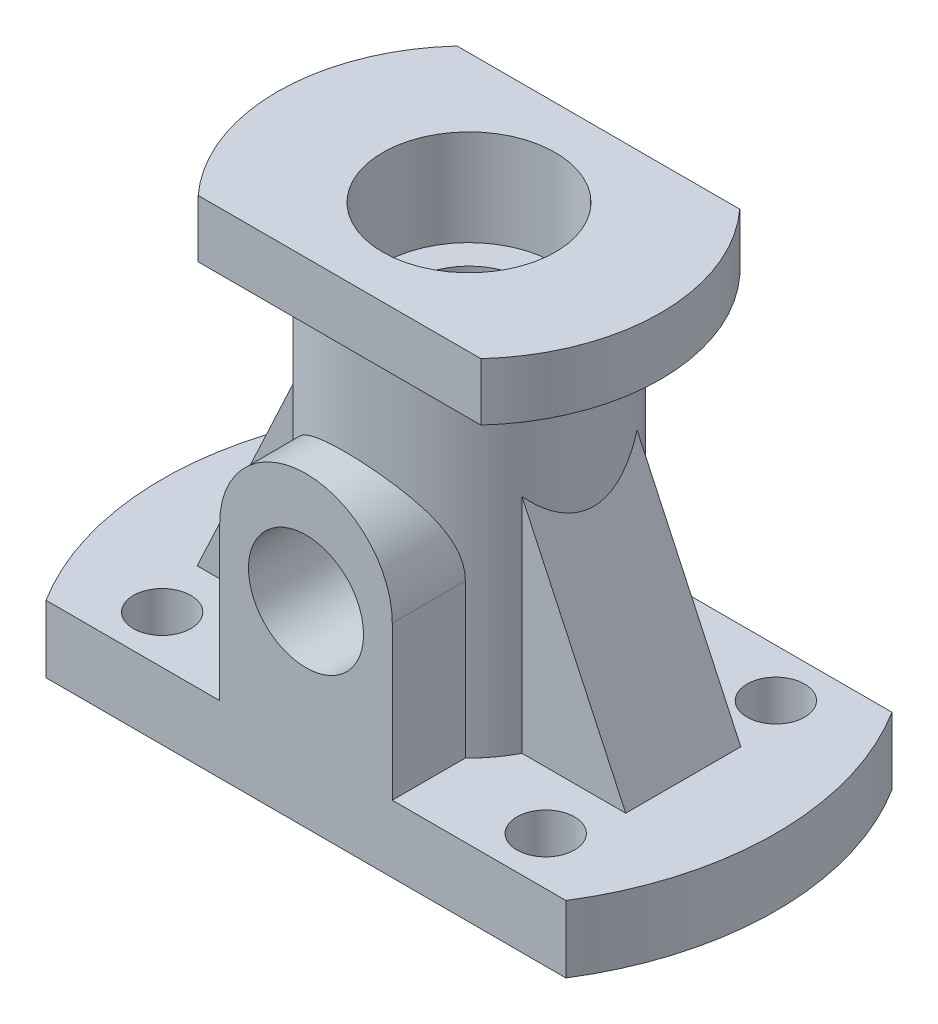
ISO-10303-21;
HEADER;
FILE_DESCRIPTION(('STEP AP214'),'2;1');
FILE_NAME('part.step','',(''),(''),'','','');
FILE_SCHEMA(('AUTOMOTIVE_DESIGN { 1 0 10303 214 1 1 1 1 }'));
ENDSEC;
DATA;
#1=APPLICATION_CONTEXT('core data for automotive mechanical design processes');
#2=APPLICATION_PROTOCOL_DEFINITION('international standard','automotive_design',2000,#1);
#3=PRODUCT_CONTEXT('',#1,'mechanical');
#4=PRODUCT('Part','Part','',(#3));
#5=PRODUCT_RELATED_PRODUCT_CATEGORY('part','',(#4));
#6=PRODUCT_DEFINITION_FORMATION('','',#4);
#7=PRODUCT_DEFINITION_CONTEXT('part definition',#1,'design');
#8=PRODUCT_DEFINITION('design','',#6,#7);
#9=PRODUCT_DEFINITION_SHAPE('','',#8);
#10=(LENGTH_UNIT() NAMED_UNIT(*) SI_UNIT(.MILLI.,.METRE.));
#11=(NAMED_UNIT(*) PLANE_ANGLE_UNIT() SI_UNIT($,.RADIAN.));
#12=(NAMED_UNIT(*) SI_UNIT($,.STERADIAN.) SOLID_ANGLE_UNIT());
#13=UNCERTAINTY_MEASURE_WITH_UNIT(LENGTH_MEASURE(1.E-05),#10,'distance_accuracy_value','');
#14=(GEOMETRIC_REPRESENTATION_CONTEXT(3) GLOBAL_UNCERTAINTY_ASSIGNED_CONTEXT((#13)) GLOBAL_UNIT_ASSIGNED_CONTEXT((#10,
#11,#12)) REPRESENTATION_CONTEXT('',''));
#15=CARTESIAN_POINT('',(0.,0.,0.));
#16=DIRECTION('',(0.,0.,1.));
#17=DIRECTION('',(1.,0.,0.));
#18=AXIS2_PLACEMENT_3D('',#15,#16,#17);
#19=CARTESIAN_POINT('',(0.,7.,0.));
#20=DIRECTION('',(0.,1.,0.));
#21=DIRECTION('',(0.,0.,1.));
#22=AXIS2_PLACEMENT_3D('',#19,#20,#21);
#23=PLANE('',#22);
#24=DIRECTION('',(-1.,0.,0.));
#25=VECTOR('',#24,1.);
#26=CARTESIAN_POINT('',(0.,7.,-6.));
#27=LINE('',#26,#25);
#28=CARTESIAN_POINT('',(22.3438266157036,7.,-6.));
#29=VERTEX_POINT('',#28);
#30=CARTESIAN_POINT('',(11.5325625946708,7.,-6.));
#31=VERTEX_POINT('',#30);
#32=EDGE_CURVE('E49',#29,#31,#27,.T.);
#33=ORIENTED_EDGE('',*,*,#32,.F.);
#34=DIRECTION('',(0.,0.,1.));
#35=VECTOR('',#34,1.);
#36=CARTESIAN_POINT('',(22.3438266156109,6.99999999997369,-6.));
#37=LINE('',#36,#35);
#38=CARTESIAN_POINT('',(22.343826615618,6.9999999999954,6.));
#39=VERTEX_POINT('',#38);
#40=EDGE_CURVE('E54',#29,#39,#37,.T.);
#41=ORIENTED_EDGE('',*,*,#40,.T.);
#42=DIRECTION('',(-1.,0.,0.));
#43=VECTOR('',#42,1.);
#44=CARTESIAN_POINT('',(0.,7.,6.));
#45=LINE('',#44,#43);
#46=CARTESIAN_POINT('',(11.5325625946708,7.,6.));
#47=VERTEX_POINT('',#46);
#48=EDGE_CURVE('E178',#39,#47,#45,.T.);
#49=ORIENTED_EDGE('',*,*,#48,.T.);
#50=CARTESIAN_POINT('',(0.,7.,0.));
#51=DIRECTION('',(0.,1.,0.));
#52=DIRECTION('',(0.,0.,1.));
#53=AXIS2_PLACEMENT_3D('',#50,#51,#52);
#54=CIRCLE('',#53,13.);
#55=CARTESIAN_POINT('',(8.99999999999999,7.,9.38083151964687));
#56=VERTEX_POINT('',#55);
#57=EDGE_CURVE('E165',#56,#47,#54,.T.);
#58=ORIENTED_EDGE('',*,*,#57,.F.);
#59=DIRECTION('',(0.,0.,1.));
#60=VECTOR('',#59,1.);
#61=CARTESIAN_POINT('',(8.99999999999999,7.,-17.001));
#62=LINE('',#61,#60);
#63=CARTESIAN_POINT('',(8.99999999999999,7.,17.));
#64=VERTEX_POINT('',#63);
#65=EDGE_CURVE('E302',#56,#64,#62,.T.);
#66=ORIENTED_EDGE('',*,*,#65,.T.);
#67=DIRECTION('',(1.,0.,0.));
#68=VECTOR('',#67,1.);
#69=CARTESIAN_POINT('',(-27.1108834234519,7.,17.));
#70=LINE('',#69,#68);
#71=CARTESIAN_POINT('',(27.1108834234519,7.,17.));
#72=VERTEX_POINT('',#71);
#73=EDGE_CURVE('E227',#64,#72,#70,.T.);
#74=ORIENTED_EDGE('',*,*,#73,.T.);
#75=CARTESIAN_POINT('',(0.,7.,0.));
#76=DIRECTION('',(0.,1.,0.));
#77=DIRECTION('',(0.,0.,1.));
#78=AXIS2_PLACEMENT_3D('',#75,#76,#77);
#79=CIRCLE('',#78,32.);
#80=CARTESIAN_POINT('',(27.1108834234519,7.,-17.));
#81=VERTEX_POINT('',#80);
#82=EDGE_CURVE('E222',#72,#81,#79,.T.);
#83=ORIENTED_EDGE('',*,*,#82,.T.);
#84=DIRECTION('',(-1.,0.,0.));
#85=VECTOR('',#84,1.);
#86=CARTESIAN_POINT('',(-27.1108834234519,7.,-17.));
#87=LINE('',#86,#85);
#88=CARTESIAN_POINT('',(-27.1108834234519,7.,-17.));
#89=VERTEX_POINT('',#88);
#90=EDGE_CURVE('E209',#81,#89,#87,.T.);
#91=ORIENTED_EDGE('',*,*,#90,.T.);
#92=CARTESIAN_POINT('',(0.,7.,0.));
#93=DIRECTION('',(0.,1.,0.));
#94=DIRECTION('',(0.,0.,1.));
#95=AXIS2_PLACEMENT_3D('',#92,#93,#94);
#96=CIRCLE('',#95,32.);
#97=CARTESIAN_POINT('',(-27.1108834234519,7.,17.));
#98=VERTEX_POINT('',#97);
#99=EDGE_CURVE('E212',#89,#98,#96,.T.);
#100=ORIENTED_EDGE('',*,*,#99,.T.);
#101=CARTESIAN_POINT('',(-9.,7.,17.));
#102=VERTEX_POINT('',#101);
#103=EDGE_CURVE('E224',#98,#102,#70,.T.);
#104=ORIENTED_EDGE('',*,*,#103,.T.);
#105=DIRECTION('',(0.,0.,1.));
#106=VECTOR('',#105,1.);
#107=CARTESIAN_POINT('',(-9.,7.,-17.001));
#108=LINE('',#107,#106);
#109=CARTESIAN_POINT('',(-9.00000000000001,7.,9.38083151964685));
#110=VERTEX_POINT('',#109);
#111=EDGE_CURVE('E301',#110,#102,#108,.T.);
#112=ORIENTED_EDGE('',*,*,#111,.F.);
#113=CARTESIAN_POINT('',(-11.5325625946708,7.,6.));
#114=VERTEX_POINT('',#113);
#115=EDGE_CURVE('E177',#114,#110,#54,.T.);
#116=ORIENTED_EDGE('',*,*,#115,.F.);
#117=DIRECTION('',(1.,0.,0.));
#118=VECTOR('',#117,1.);
#119=CARTESIAN_POINT('',(0.,7.,6.));
#120=LINE('',#119,#118);
#121=CARTESIAN_POINT('',(-22.3438266156109,6.99999999997813,6.));
#122=VERTEX_POINT('',#121);
#123=EDGE_CURVE('E437',#122,#114,#120,.T.);
#124=ORIENTED_EDGE('',*,*,#123,.F.);
#125=DIRECTION('',(0.,0.,1.));
#126=VECTOR('',#125,1.);
#127=CARTESIAN_POINT('',(-22.3438266156109,6.99999999997813,-6.));
#128=LINE('',#127,#126);
#129=CARTESIAN_POINT('',(-22.3438266156109,6.99999999997813,-6.));
#130=VERTEX_POINT('',#129);
#131=EDGE_CURVE('E448',#130,#122,#128,.T.);
#132=ORIENTED_EDGE('',*,*,#131,.F.);
#133=DIRECTION('',(1.,0.,0.));
#134=VECTOR('',#133,1.);
#135=CARTESIAN_POINT('',(0.,7.,-6.));
#136=LINE('',#135,#134);
#137=CARTESIAN_POINT('',(-11.5325625946708,7.,-6.));
#138=VERTEX_POINT('',#137);
#139=EDGE_CURVE('E444',#130,#138,#136,.T.);
#140=ORIENTED_EDGE('',*,*,#139,.T.);
#141=EDGE_CURVE('E175',#31,#138,#54,.T.);
#142=ORIENTED_EDGE('',*,*,#141,.F.);
#143=EDGE_LOOP('',(#33,#41,#49,#58,#66,#74,#83,#91,#100,#104,#112,#116,#124,#132,#140,#142));
#144=FACE_BOUND('',#143,.T.);
#145=CARTESIAN_POINT('',(-20.,7.,-12.));
#146=DIRECTION('',(0.,-1.,0.));
#147=DIRECTION('',(0.,0.,-1.));
#148=AXIS2_PLACEMENT_3D('',#145,#146,#147);
#149=CIRCLE('',#148,3.);
#150=CARTESIAN_POINT('',(-20.,7.,-15.));
#151=VERTEX_POINT('',#150);
#152=EDGE_CURVE('E248',#151,#151,#149,.T.);
#153=ORIENTED_EDGE('',*,*,#152,.T.);
#154=EDGE_LOOP('',(#153));
#155=FACE_BOUND('',#154,.T.);
#156=CARTESIAN_POINT('',(20.,7.,-12.));
#157=DIRECTION('',(0.,1.,0.));
#158=DIRECTION('',(0.,0.,-1.));
#159=AXIS2_PLACEMENT_3D('',#156,#157,#158);
#160=CIRCLE('',#159,3.);
#161=CARTESIAN_POINT('',(20.,7.,-15.));
#162=VERTEX_POINT('',#161);
#163=EDGE_CURVE('E242',#162,#162,#160,.T.);
#164=ORIENTED_EDGE('',*,*,#163,.F.);
#165=EDGE_LOOP('',(#164));
#166=FACE_BOUND('',#165,.T.);
#167=CARTESIAN_POINT('',(20.,7.,12.));
#168=DIRECTION('',(0.,-1.,0.));
#169=DIRECTION('',(0.,0.,1.));
#170=AXIS2_PLACEMENT_3D('',#167,#168,#169);
#171=CIRCLE('',#170,3.);
#172=CARTESIAN_POINT('',(20.,7.,15.));
#173=VERTEX_POINT('',#172);
#174=EDGE_CURVE('E236',#173,#173,#171,.T.);
#175=ORIENTED_EDGE('',*,*,#174,.T.);
#176=EDGE_LOOP('',(#175));
#177=FACE_BOUND('',#176,.T.);
#178=CARTESIAN_POINT('',(-20.,7.,12.));
#179=DIRECTION('',(0.,1.,0.));
#180=DIRECTION('',(0.,0.,1.));
#181=AXIS2_PLACEMENT_3D('',#178,#179,#180);
#182=CIRCLE('',#181,3.);
#183=CARTESIAN_POINT('',(-20.,7.,15.));
#184=VERTEX_POINT('',#183);
#185=EDGE_CURVE('E230',#184,#184,#182,.T.);
#186=ORIENTED_EDGE('',*,*,#185,.F.);
#187=EDGE_LOOP('',(#186));
#188=FACE_BOUND('',#187,.T.);
#189=ADVANCED_FACE('F34',(#144,#155,#166,#177,#188),#23,.T.);
#190=CARTESIAN_POINT('',(0.,42.,0.));
#191=DIRECTION('',(0.,-1.,0.));
#192=DIRECTION('',(0.,0.,-1.));
#193=AXIS2_PLACEMENT_3D('',#190,#191,#192);
#194=CYLINDRICAL_SURFACE('',#193,13.);
#195=CARTESIAN_POINT('',(0.,42.,0.));
#196=DIRECTION('',(0.,1.,0.));
#197=DIRECTION('',(0.,0.,1.));
#198=AXIS2_PLACEMENT_3D('',#195,#196,#197);
#199=CIRCLE('',#198,13.);
#200=CARTESIAN_POINT('',(0.,42.,13.));
#201=VERTEX_POINT('',#200);
#202=EDGE_CURVE('E174',#201,#201,#199,.T.);
#203=ORIENTED_EDGE('',*,*,#202,.F.);
#204=EDGE_LOOP('',(#203));
#205=FACE_BOUND('',#204,.T.);
#206=CARTESIAN_POINT('',(0.,54.9164908080559,0.));
#207=DIRECTION('',(-0.906307787036651,-0.422618261740697,0.));
#208=DIRECTION('',(0.422618261740697,-0.906307787036651,0.));
#209=AXIS2_PLACEMENT_3D('',#206,#207,#208);
#210=ELLIPSE('',#209,30.7606205809827,13.);
#211=CARTESIAN_POINT('',(11.5325625945886,30.184830512539,-6.));
#212=VERTEX_POINT('',#211);
#213=CARTESIAN_POINT('',(11.5325625946652,30.1848305123826,6.));
#214=VERTEX_POINT('',#213);
#215=EDGE_CURVE('E42',#212,#214,#210,.T.);
#216=ORIENTED_EDGE('',*,*,#215,.F.);
#217=DIRECTION('',(0.,-1.,0.));
#218=VECTOR('',#217,1.);
#219=CARTESIAN_POINT('',(11.5325625946708,42.,-6.));
#220=LINE('',#219,#218);
#221=EDGE_CURVE('E11',#212,#31,#220,.T.);
#222=ORIENTED_EDGE('',*,*,#221,.T.);
#223=ORIENTED_EDGE('',*,*,#141,.T.);
#224=DIRECTION('',(0.,-1.,0.));
#225=VECTOR('',#224,1.);
#226=CARTESIAN_POINT('',(-11.5325625946708,42.,-6.));
#227=LINE('',#226,#225);
#228=CARTESIAN_POINT('',(-11.5325625947043,30.1848305124395,-6.));
#229=VERTEX_POINT('',#228);
#230=EDGE_CURVE('E186',#229,#138,#227,.T.);
#231=ORIENTED_EDGE('',*,*,#230,.F.);
#232=CARTESIAN_POINT('',(0.,54.916490807955,0.));
#233=DIRECTION('',(-0.906307787036651,0.422618261740697,0.));
#234=DIRECTION('',(-0.422618261740697,-0.906307787036651,0.));
#235=AXIS2_PLACEMENT_3D('',#232,#233,#234);
#236=ELLIPSE('',#235,30.7606205809827,13.);
#237=CARTESIAN_POINT('',(-11.5325625947043,30.1848305124395,6.));
#238=VERTEX_POINT('',#237);
#239=EDGE_CURVE('E189',#229,#238,#236,.T.);
#240=ORIENTED_EDGE('',*,*,#239,.T.);
#241=DIRECTION('',(0.,-1.,0.));
#242=VECTOR('',#241,1.);
#243=CARTESIAN_POINT('',(-11.5325625946708,42.,6.));
#244=LINE('',#243,#242);
#245=EDGE_CURVE('E194',#238,#114,#244,.T.);
#246=ORIENTED_EDGE('',*,*,#245,.T.);
#247=ORIENTED_EDGE('',*,*,#115,.T.);
#248=DIRECTION('',(0.,-1.,0.));
#249=VECTOR('',#248,1.);
#250=CARTESIAN_POINT('',(-9.00000000000001,42.,9.38083151964685));
#251=LINE('',#250,#249);
#252=CARTESIAN_POINT('',(-9.00000000000001,23.,9.38083151964686));
#253=VERTEX_POINT('',#252);
#254=EDGE_CURVE('E298',#253,#110,#251,.T.);
#255=ORIENTED_EDGE('',*,*,#254,.F.);
#256=CARTESIAN_POINT('',(8.99999999999999,23.,9.38083151964687));
#257=CARTESIAN_POINT('',(9.00000195551193,23.109281590863,9.38082570992441));
#258=CARTESIAN_POINT('',(8.99800899360824,23.2185439624175,9.3827421352152));
#259=CARTESIAN_POINT('',(8.9900579091309,23.4367797007814,9.39036227277861));
#260=CARTESIAN_POINT('',(8.98410024589007,23.5457530996018,9.39606554632352));
#261=CARTESIAN_POINT('',(8.96034474196164,23.87151493557,9.41874360903439));
#262=CARTESIAN_POINT('',(8.93666419500784,24.0875358163211,9.44128704880778));
#263=CARTESIAN_POINT('',(8.8744738288663,24.5131115491226,9.49976263371282));
#264=CARTESIAN_POINT('',(8.83612533575313,24.7227108484366,9.53554899145174));
#265=CARTESIAN_POINT('',(8.7453041313183,25.1364779137659,9.61891100850264));
#266=CARTESIAN_POINT('',(8.69282665967837,25.3406438236485,9.66649064076063));
#267=CARTESIAN_POINT('',(8.57490389625952,25.741234069921,9.77124281519535));
#268=CARTESIAN_POINT('',(8.50953777839023,25.9376973022298,9.82835647736649));
#269=CARTESIAN_POINT('',(8.36642586105672,26.3234408721501,9.95046682567776));
#270=CARTESIAN_POINT('',(8.2886808296628,26.5127216545068,10.0154630226733));
#271=CARTESIAN_POINT('',(8.03734070978798,27.0703409407484,10.2199652818551));
#272=CARTESIAN_POINT('',(7.84592988373192,27.4274903208693,10.3687160605543));
#273=CARTESIAN_POINT('',(7.50863541089303,27.9674585322767,10.6133962963535));
#274=CARTESIAN_POINT('',(7.37683576095049,28.1611015098971,10.7056204905726));
#275=CARTESIAN_POINT('',(7.0989752094002,28.5370710791971,10.8918538235022));
#276=CARTESIAN_POINT('',(6.95291328416345,28.7193968570826,10.9858630899399));
#277=CARTESIAN_POINT('',(6.64692711418783,29.0723095998355,11.1736572379947));
#278=CARTESIAN_POINT('',(6.48699586896818,29.2428905577114,11.2674419814545));
#279=CARTESIAN_POINT('',(6.15370949500605,29.5716546118136,11.4528698100124));
#280=CARTESIAN_POINT('',(5.98035451098949,29.729837841667,11.5445129181863));
#281=CARTESIAN_POINT('',(5.59144218585635,30.0576554486902,11.73841164456));
#282=CARTESIAN_POINT('',(5.37359691648462,30.2249954744972,11.8399823297032));
#283=CARTESIAN_POINT('',(4.92100887547878,30.540541819655,12.0351321535615));
#284=CARTESIAN_POINT('',(4.68626308715376,30.6887447098312,12.1287098590041));
#285=CARTESIAN_POINT('',(4.20134449187811,30.9640643577582,12.3050870557945));
#286=CARTESIAN_POINT('',(3.95119487188301,31.0912117944038,12.3879021901926));
#287=CARTESIAN_POINT('',(3.4367774584561,31.322741565789,12.5403521593611));
#288=CARTESIAN_POINT('',(3.17251569031229,31.4271335209218,12.6099925623948));
#289=CARTESIAN_POINT('',(2.70356685284892,31.5868997161352,12.7174034752232));
#290=CARTESIAN_POINT('',(2.50160340717033,31.6479363713446,12.7587319257392));
#291=CARTESIAN_POINT('',(2.09233338300934,31.7559639035567,12.8321989831048));
#292=CARTESIAN_POINT('',(1.88502792696469,31.8029577054557,12.864339503589));
#293=CARTESIAN_POINT('',(1.46648324581179,31.8822726544217,12.9187435720911));
#294=CARTESIAN_POINT('',(1.25524658293398,31.9146030324491,12.9410133337758));
#295=CARTESIAN_POINT('',(0.830166009123618,31.964184798963,12.9752181499993));
#296=CARTESIAN_POINT('',(0.616322010714009,31.9814356801075,12.9871528568202));
#297=CARTESIAN_POINT('',(0.18721772249226,32.0006199324661,13.0004273316533));
#298=CARTESIAN_POINT('',(-0.0280444627712524,32.0025247295307,13.0017473352587));
#299=CARTESIAN_POINT('',(-0.457949855893796,31.990913227742,12.9937101433514));
#300=CARTESIAN_POINT('',(-0.672593066057449,31.9773969863801,12.9843529876444));
#301=CARTESIAN_POINT('',(-1.09970273772065,31.9351396178258,12.9551722125125));
#302=CARTESIAN_POINT('',(-1.31216866187518,31.9063948203397,12.9353460699199));
#303=CARTESIAN_POINT('',(-1.73336379307759,31.834088038531,12.8856673119349));
#304=CARTESIAN_POINT('',(-1.94209299351825,31.7905260280116,12.8558146788157));
#305=CARTESIAN_POINT('',(-2.35003550559376,31.6902535141929,12.7874622703602));
#306=CARTESIAN_POINT('',(-2.54935689942801,31.6338451751435,12.749161768409));
#307=CARTESIAN_POINT('',(-2.94211247406125,31.5080264883626,12.6642945909378));
#308=CARTESIAN_POINT('',(-3.13554456047184,31.4386115765204,12.6177250140343));
#309=CARTESIAN_POINT('',(-3.51549356594057,31.2875264071346,12.5171848095962));
#310=CARTESIAN_POINT('',(-3.70201244829318,31.2058596627887,12.463216304076));
#311=CARTESIAN_POINT('',(-4.06753685818809,31.0309535585355,12.348758699626));
#312=CARTESIAN_POINT('',(-4.24653963762661,30.9377100142822,12.2882672440704));
#313=CARTESIAN_POINT('',(-4.61602158168554,30.7293099745617,12.1546344322415));
#314=CARTESIAN_POINT('',(-4.80553832809483,30.612868791531,12.0808351665864));
#315=CARTESIAN_POINT('',(-5.173989360595,30.3674191605768,11.9276847196055));
#316=CARTESIAN_POINT('',(-5.35291904518245,30.2384053116922,11.8483311564275));
#317=CARTESIAN_POINT('',(-5.69981637027412,29.9685310181206,11.6854114245313));
#318=CARTESIAN_POINT('',(-5.86777534375117,29.8276614035297,11.6018420154326));
#319=CARTESIAN_POINT('',(-6.19224456106074,29.5348203980515,11.431957495225));
#320=CARTESIAN_POINT('',(-6.34875364651583,29.3828478869916,11.3456421075714));
#321=CARTESIAN_POINT('',(-6.67641361881072,29.0407777396719,11.1564898135338));
#322=CARTESIAN_POINT('',(-6.84532621916437,28.8486651871741,11.0534076129591));
#323=CARTESIAN_POINT('',(-7.16641572878554,28.4504979498017,10.8479870365356));
#324=CARTESIAN_POINT('',(-7.31858910957649,28.2444403401638,10.7456488217418));
#325=CARTESIAN_POINT('',(-7.60553643363539,27.8188830062757,10.5445009375273));
#326=CARTESIAN_POINT('',(-7.74031137228793,27.5993840520803,10.4456910664801));
#327=CARTESIAN_POINT('',(-7.9915391373413,27.1475513822524,10.2547649559516));
#328=CARTESIAN_POINT('',(-8.10799821776646,26.9152220843643,10.1626464374876));
#329=CARTESIAN_POINT('',(-8.37594883000305,26.3164415024092,9.94417772623478));
#330=CARTESIAN_POINT('',(-8.51515524828116,25.9418459879001,9.82423006095671));
#331=CARTESIAN_POINT('',(-8.68668936681557,25.3626069794905,9.67198425621952));
#332=CARTESIAN_POINT('',(-8.73761413561112,25.1668931133167,9.62588888888995));
#333=CARTESIAN_POINT('',(-8.82649441159562,24.7703763684949,9.5444551602522));
#334=CARTESIAN_POINT('',(-8.86445517899176,24.5695755894974,9.50911243664286));
#335=CARTESIAN_POINT('',(-8.93005649492109,24.142585050387,9.44755876816321));
#336=CARTESIAN_POINT('',(-8.95618093455732,23.9159561855554,9.42270895524074));
#337=CARTESIAN_POINT('',(-8.98241701261065,23.5738836364075,9.3976759035881));
#338=CARTESIAN_POINT('',(-8.98900405178584,23.4593269959356,9.39137160742606));
#339=CARTESIAN_POINT('',(-8.99779746245777,23.2298546139967,9.38294519204892));
#340=CARTESIAN_POINT('',(-9.00000238102187,23.1149387660754,9.38082445993492));
#341=CARTESIAN_POINT('',(-9.00000000000001,23.,9.38083151964685));
#342=B_SPLINE_CURVE_WITH_KNOTS('',3,(#256,#257,#258,#259,#260,#261,#262,#263,#264,#265,#266,
#267,#268,#269,#270,#271,#272,#273,#274,#275,#276,#277,#278,#279,#280,#281,#282,#283,#284,#285,
#286,#287,#288,#289,#290,#291,#292,#293,#294,#295,#296,#297,#298,#299,#300,#301,#302,#303,#304,
#305,#306,#307,#308,#309,#310,#311,#312,#313,#314,#315,#316,#317,#318,#319,#320,#321,#322,#323,
#324,#325,#326,#327,#328,#329,#330,#331,#332,#333,#334,#335,#336,#337,#338,#339,#340,#341),
.UNSPECIFIED.,.F.,.F.,(4,2,2,2,2,2,2,2,2,2,2,2,2,2,2,2,2,2,2,2,2,2,2,2,2,2,2,2,2,2,2,2,2,2,2,2,
2,2,2,2,2,2,4),(0.,0.327772404152453,0.655506840648769,1.30980863104586,1.9571118806618,
2.60463349240516,3.24829484557938,3.89191627726454,5.1822615780435,5.93697645954376,
6.69174554815043,7.44689784568076,8.20204200278952,9.0794830119005,9.95708103172238,
10.8333888748605,11.7093255174423,12.3536499645513,12.9978401157488,13.6416241697261,
14.2854298826545,14.9304340745436,15.5754358617885,16.220593174203,16.8657516272622,
17.4970677330642,18.1286057890464,18.7599630971965,19.3915492726127,20.0939252077021,
20.7966042105069,21.499831788749,22.2031304139446,23.0296378155787,23.8563191050121,
24.6829530780913,25.5093041779424,26.755716357767,27.3773621908184,27.9987554874993,
28.685868850405,29.0304857002905,29.3752167920314),.UNSPECIFIED.);
#343=CARTESIAN_POINT('',(8.99999999999999,23.,9.38083151964687));
#344=VERTEX_POINT('',#343);
#345=EDGE_CURVE('E303',#344,#253,#342,.T.);
#346=ORIENTED_EDGE('',*,*,#345,.F.);
#347=DIRECTION('',(0.,-1.,0.));
#348=VECTOR('',#347,1.);
#349=CARTESIAN_POINT('',(8.99999999999999,42.,9.38083151964687));
#350=LINE('',#349,#348);
#351=EDGE_CURVE('E172',#56,#344,#350,.F.);
#352=ORIENTED_EDGE('',*,*,#351,.F.);
#353=ORIENTED_EDGE('',*,*,#57,.T.);
#354=DIRECTION('',(0.,-1.,0.));
#355=VECTOR('',#354,1.);
#356=CARTESIAN_POINT('',(11.5325625946708,42.,6.));
#357=LINE('',#356,#355);
#358=EDGE_CURVE('E168',#214,#47,#357,.T.);
#359=ORIENTED_EDGE('',*,*,#358,.F.);
#360=EDGE_LOOP('',(#216,#222,#223,#231,#240,#246,#247,#255,#346,#352,#353,#359));
#361=FACE_BOUND('',#360,.T.);
#362=ADVANCED_FACE('F166',(#205,#361),#194,.T.);
#363=CARTESIAN_POINT('',(0.,7.,0.));
#364=DIRECTION('',(0.,-1.,0.));
#365=DIRECTION('',(0.,0.,-1.));
#366=AXIS2_PLACEMENT_3D('',#363,#364,#365);
#367=CYLINDRICAL_SURFACE('',#366,32.);
#368=CARTESIAN_POINT('',(0.,0.,0.));
#369=DIRECTION('',(0.,1.,0.));
#370=DIRECTION('',(0.,0.,1.));
#371=AXIS2_PLACEMENT_3D('',#368,#369,#370);
#372=CIRCLE('',#371,32.);
#373=CARTESIAN_POINT('',(-27.1108834234519,0.,-17.));
#374=VERTEX_POINT('',#373);
#375=CARTESIAN_POINT('',(-27.1108834234519,0.,17.));
#376=VERTEX_POINT('',#375);
#377=EDGE_CURVE('E217',#374,#376,#372,.T.);
#378=ORIENTED_EDGE('',*,*,#377,.T.);
#379=DIRECTION('',(0.,-1.,0.));
#380=VECTOR('',#379,1.);
#381=CARTESIAN_POINT('',(-27.1108834234519,7.,17.));
#382=LINE('',#381,#380);
#383=EDGE_CURVE('E197',#98,#376,#382,.T.);
#384=ORIENTED_EDGE('',*,*,#383,.F.);
#385=ORIENTED_EDGE('',*,*,#99,.F.);
#386=DIRECTION('',(0.,-1.,0.));
#387=VECTOR('',#386,1.);
#388=CARTESIAN_POINT('',(-27.1108834234519,7.,-17.));
#389=LINE('',#388,#387);
#390=EDGE_CURVE('E206',#89,#374,#389,.T.);
#391=ORIENTED_EDGE('',*,*,#390,.T.);
#392=EDGE_LOOP('',(#378,#384,#385,#391));
#393=FACE_BOUND('',#392,.T.);
#394=ADVANCED_FACE('F36',(#393),#367,.T.);
#395=CARTESIAN_POINT('',(-27.1108834234519,7.,17.));
#396=DIRECTION('',(0.,0.,-1.));
#397=DIRECTION('',(-1.,0.,0.));
#398=AXIS2_PLACEMENT_3D('',#395,#396,#397);
#399=PLANE('',#398);
#400=CARTESIAN_POINT('',(0.,20.461682424341,17.));
#401=DIRECTION('',(0.,0.,1.));
#402=DIRECTION('',(1.,0.,0.));
#403=AXIS2_PLACEMENT_3D('',#400,#401,#402);
#404=CIRCLE('',#403,6.);
#405=CARTESIAN_POINT('',(6.,20.461682424341,17.));
#406=VERTEX_POINT('',#405);
#407=EDGE_CURVE('E400',#406,#406,#404,.T.);
#408=ORIENTED_EDGE('',*,*,#407,.F.);
#409=EDGE_LOOP('',(#408));
#410=FACE_BOUND('',#409,.T.);
#411=DIRECTION('',(1.,0.,0.));
#412=VECTOR('',#411,1.);
#413=CARTESIAN_POINT('',(-27.1108834234519,0.,17.));
#414=LINE('',#413,#412);
#415=CARTESIAN_POINT('',(27.1108834234519,0.,17.));
#416=VERTEX_POINT('',#415);
#417=EDGE_CURVE('E215',#376,#416,#414,.T.);
#418=ORIENTED_EDGE('',*,*,#417,.T.);
#419=DIRECTION('',(0.,-1.,0.));
#420=VECTOR('',#419,1.);
#421=CARTESIAN_POINT('',(27.1108834234519,7.,17.));
#422=LINE('',#421,#420);
#423=EDGE_CURVE('E200',#72,#416,#422,.T.);
#424=ORIENTED_EDGE('',*,*,#423,.F.);
#425=ORIENTED_EDGE('',*,*,#73,.F.);
#426=DIRECTION('',(0.,1.,0.));
#427=VECTOR('',#426,1.);
#428=CARTESIAN_POINT('',(8.99999999999999,23.,17.));
#429=LINE('',#428,#427);
#430=CARTESIAN_POINT('',(8.99999999999999,23.,17.));
#431=VERTEX_POINT('',#430);
#432=EDGE_CURVE('E416',#64,#431,#429,.T.);
#433=ORIENTED_EDGE('',*,*,#432,.T.);
#434=CARTESIAN_POINT('',(0.,23.,17.));
#435=DIRECTION('',(0.,0.,1.));
#436=DIRECTION('',(1.,0.,0.));
#437=AXIS2_PLACEMENT_3D('',#434,#435,#436);
#438=CIRCLE('',#437,9.);
#439=CARTESIAN_POINT('',(-9.00000000000001,23.,17.));
#440=VERTEX_POINT('',#439);
#441=EDGE_CURVE('E419',#431,#440,#438,.T.);
#442=ORIENTED_EDGE('',*,*,#441,.T.);
#443=DIRECTION('',(0.,-1.,0.));
#444=VECTOR('',#443,1.);
#445=CARTESIAN_POINT('',(-9.,7.,17.));
#446=LINE('',#445,#444);
#447=EDGE_CURVE('E295',#440,#102,#446,.T.);
#448=ORIENTED_EDGE('',*,*,#447,.T.);
#449=ORIENTED_EDGE('',*,*,#103,.F.);
#450=ORIENTED_EDGE('',*,*,#383,.T.);
#451=EDGE_LOOP('',(#418,#424,#425,#433,#442,#448,#449,#450));
#452=FACE_BOUND('',#451,.T.);
#453=ADVANCED_FACE('F389',(#410,#452),#399,.F.);
#454=CARTESIAN_POINT('',(0.,7.,0.));
#455=DIRECTION('',(0.,-1.,0.));
#456=DIRECTION('',(0.,0.,-1.));
#457=AXIS2_PLACEMENT_3D('',#454,#455,#456);
#458=CYLINDRICAL_SURFACE('',#457,32.);
#459=CARTESIAN_POINT('',(0.,0.,0.));
#460=DIRECTION('',(0.,1.,0.));
#461=DIRECTION('',(0.,0.,1.));
#462=AXIS2_PLACEMENT_3D('',#459,#460,#461);
#463=CIRCLE('',#462,32.);
#464=CARTESIAN_POINT('',(27.1108834234519,0.,-17.));
#465=VERTEX_POINT('',#464);
#466=EDGE_CURVE('E213',#416,#465,#463,.T.);
#467=ORIENTED_EDGE('',*,*,#466,.T.);
#468=DIRECTION('',(0.,-1.,0.));
#469=VECTOR('',#468,1.);
#470=CARTESIAN_POINT('',(27.1108834234519,7.,-17.));
#471=LINE('',#470,#469);
#472=EDGE_CURVE('E203',#81,#465,#471,.T.);
#473=ORIENTED_EDGE('',*,*,#472,.F.);
#474=ORIENTED_EDGE('',*,*,#82,.F.);
#475=ORIENTED_EDGE('',*,*,#423,.T.);
#476=EDGE_LOOP('',(#467,#473,#474,#475));
#477=FACE_BOUND('',#476,.T.);
#478=ADVANCED_FACE('F386',(#477),#458,.T.);
#479=CARTESIAN_POINT('',(-27.1108834234519,7.,-17.));
#480=DIRECTION('',(0.,0.,1.));
#481=DIRECTION('',(1.,0.,0.));
#482=AXIS2_PLACEMENT_3D('',#479,#480,#481);
#483=PLANE('',#482);
#484=DIRECTION('',(-1.,0.,0.));
#485=VECTOR('',#484,1.);
#486=CARTESIAN_POINT('',(-27.1108834234519,0.,-17.));
#487=LINE('',#486,#485);
#488=EDGE_CURVE('E210',#465,#374,#487,.T.);
#489=ORIENTED_EDGE('',*,*,#488,.T.);
#490=ORIENTED_EDGE('',*,*,#390,.F.);
#491=ORIENTED_EDGE('',*,*,#90,.F.);
#492=ORIENTED_EDGE('',*,*,#472,.T.);
#493=EDGE_LOOP('',(#489,#490,#491,#492));
#494=FACE_BOUND('',#493,.T.);
#495=ADVANCED_FACE('F382',(#494),#483,.F.);
#496=CARTESIAN_POINT('',(0.,0.,0.));
#497=DIRECTION('',(0.,1.,0.));
#498=DIRECTION('',(0.,0.,1.));
#499=AXIS2_PLACEMENT_3D('',#496,#497,#498);
#500=PLANE('',#499);
#501=CARTESIAN_POINT('',(0.,0.,0.));
#502=DIRECTION('',(0.,1.,0.));
#503=DIRECTION('',(0.,0.,1.));
#504=AXIS2_PLACEMENT_3D('',#501,#502,#503);
#505=CIRCLE('',#504,6.);
#506=CARTESIAN_POINT('',(0.,0.,6.));
#507=VERTEX_POINT('',#506);
#508=EDGE_CURVE('E289',#507,#507,#505,.T.);
#509=ORIENTED_EDGE('',*,*,#508,.T.);
#510=EDGE_LOOP('',(#509));
#511=FACE_BOUND('',#510,.T.);
#512=CARTESIAN_POINT('',(-20.,0.,-12.));
#513=DIRECTION('',(0.,-1.,0.));
#514=DIRECTION('',(0.,0.,-1.));
#515=AXIS2_PLACEMENT_3D('',#512,#513,#514);
#516=CIRCLE('',#515,3.);
#517=CARTESIAN_POINT('',(-20.,0.,-15.));
#518=VERTEX_POINT('',#517);
#519=EDGE_CURVE('E245',#518,#518,#516,.T.);
#520=ORIENTED_EDGE('',*,*,#519,.F.);
#521=EDGE_LOOP('',(#520));
#522=FACE_BOUND('',#521,.T.);
#523=CARTESIAN_POINT('',(20.,0.,-12.));
#524=DIRECTION('',(0.,1.,0.));
#525=DIRECTION('',(0.,0.,-1.));
#526=AXIS2_PLACEMENT_3D('',#523,#524,#525);
#527=CIRCLE('',#526,3.);
#528=CARTESIAN_POINT('',(20.,0.,-15.));
#529=VERTEX_POINT('',#528);
#530=EDGE_CURVE('E239',#529,#529,#527,.T.);
#531=ORIENTED_EDGE('',*,*,#530,.T.);
#532=EDGE_LOOP('',(#531));
#533=FACE_BOUND('',#532,.T.);
#534=CARTESIAN_POINT('',(20.,0.,12.));
#535=DIRECTION('',(0.,-1.,0.));
#536=DIRECTION('',(0.,0.,1.));
#537=AXIS2_PLACEMENT_3D('',#534,#535,#536);
#538=CIRCLE('',#537,3.);
#539=CARTESIAN_POINT('',(20.,0.,15.));
#540=VERTEX_POINT('',#539);
#541=EDGE_CURVE('E233',#540,#540,#538,.T.);
#542=ORIENTED_EDGE('',*,*,#541,.F.);
#543=EDGE_LOOP('',(#542));
#544=FACE_BOUND('',#543,.T.);
#545=CARTESIAN_POINT('',(-20.,0.,12.));
#546=DIRECTION('',(0.,1.,0.));
#547=DIRECTION('',(0.,0.,1.));
#548=AXIS2_PLACEMENT_3D('',#545,#546,#547);
#549=CIRCLE('',#548,3.);
#550=CARTESIAN_POINT('',(-20.,0.,15.));
#551=VERTEX_POINT('',#550);
#552=EDGE_CURVE('E220',#551,#551,#549,.T.);
#553=ORIENTED_EDGE('',*,*,#552,.T.);
#554=EDGE_LOOP('',(#553));
#555=FACE_BOUND('',#554,.T.);
#556=ORIENTED_EDGE('',*,*,#377,.F.);
#557=ORIENTED_EDGE('',*,*,#488,.F.);
#558=ORIENTED_EDGE('',*,*,#466,.F.);
#559=ORIENTED_EDGE('',*,*,#417,.F.);
#560=EDGE_LOOP('',(#556,#557,#558,#559));
#561=FACE_BOUND('',#560,.T.);
#562=ADVANCED_FACE('F376',(#511,#522,#533,#544,#555,#561),#500,.F.);
#563=CARTESIAN_POINT('',(-20.,0.,12.));
#564=DIRECTION('',(0.,1.,0.));
#565=DIRECTION('',(0.,0.,1.));
#566=AXIS2_PLACEMENT_3D('',#563,#564,#565);
#567=CYLINDRICAL_SURFACE('',#566,3.);
#568=ORIENTED_EDGE('',*,*,#552,.F.);
#569=EDGE_LOOP('',(#568));
#570=FACE_BOUND('',#569,.T.);
#571=ORIENTED_EDGE('',*,*,#185,.T.);
#572=EDGE_LOOP('',(#571));
#573=FACE_BOUND('',#572,.T.);
#574=ADVANCED_FACE('F372',(#570,#573),#567,.F.);
#575=CARTESIAN_POINT('',(20.,0.,12.));
#576=DIRECTION('',(0.,1.,0.));
#577=DIRECTION('',(0.,0.,1.));
#578=AXIS2_PLACEMENT_3D('',#575,#576,#577);
#579=CYLINDRICAL_SURFACE('',#578,3.);
#580=ORIENTED_EDGE('',*,*,#541,.T.);
#581=EDGE_LOOP('',(#580));
#582=FACE_BOUND('',#581,.T.);
#583=ORIENTED_EDGE('',*,*,#174,.F.);
#584=EDGE_LOOP('',(#583));
#585=FACE_BOUND('',#584,.T.);
#586=ADVANCED_FACE('F368',(#582,#585),#579,.F.);
#587=CARTESIAN_POINT('',(20.,0.,-12.));
#588=DIRECTION('',(0.,1.,0.));
#589=DIRECTION('',(0.,0.,1.));
#590=AXIS2_PLACEMENT_3D('',#587,#588,#589);
#591=CYLINDRICAL_SURFACE('',#590,3.);
#592=ORIENTED_EDGE('',*,*,#530,.F.);
#593=EDGE_LOOP('',(#592));
#594=FACE_BOUND('',#593,.T.);
#595=ORIENTED_EDGE('',*,*,#163,.T.);
#596=EDGE_LOOP('',(#595));
#597=FACE_BOUND('',#596,.T.);
#598=ADVANCED_FACE('F364',(#594,#597),#591,.F.);
#599=CARTESIAN_POINT('',(-20.,0.,-12.));
#600=DIRECTION('',(0.,1.,0.));
#601=DIRECTION('',(0.,0.,1.));
#602=AXIS2_PLACEMENT_3D('',#599,#600,#601);
#603=CYLINDRICAL_SURFACE('',#602,3.);
#604=ORIENTED_EDGE('',*,*,#519,.T.);
#605=EDGE_LOOP('',(#604));
#606=FACE_BOUND('',#605,.T.);
#607=ORIENTED_EDGE('',*,*,#152,.F.);
#608=EDGE_LOOP('',(#607));
#609=FACE_BOUND('',#608,.T.);
#610=ADVANCED_FACE('F357',(#606,#609),#603,.F.);
#611=CARTESIAN_POINT('',(0.,48.,0.));
#612=DIRECTION('',(0.,-1.,0.));
#613=DIRECTION('',(0.,0.,-1.));
#614=AXIS2_PLACEMENT_3D('',#611,#612,#613);
#615=CYLINDRICAL_SURFACE('',#614,19.98567914731);
#616=CARTESIAN_POINT('',(0.,42.,0.));
#617=DIRECTION('',(0.,1.,0.));
#618=DIRECTION('',(0.,0.,1.));
#619=AXIS2_PLACEMENT_3D('',#616,#617,#618);
#620=CIRCLE('',#619,19.98567914731);
#621=CARTESIAN_POINT('',(-14.7369389962509,42.,-13.5));
#622=VERTEX_POINT('',#621);
#623=CARTESIAN_POINT('',(-14.7369389962509,42.,13.5));
#624=VERTEX_POINT('',#623);
#625=EDGE_CURVE('E275',#622,#624,#620,.T.);
#626=ORIENTED_EDGE('',*,*,#625,.T.);
#627=DIRECTION('',(0.,-1.,0.));
#628=VECTOR('',#627,1.);
#629=CARTESIAN_POINT('',(-14.7369389962509,48.,13.5));
#630=LINE('',#629,#628);
#631=CARTESIAN_POINT('',(-14.7369389962509,48.,13.5));
#632=VERTEX_POINT('',#631);
#633=EDGE_CURVE('E255',#632,#624,#630,.T.);
#634=ORIENTED_EDGE('',*,*,#633,.F.);
#635=CARTESIAN_POINT('',(0.,48.,0.));
#636=DIRECTION('',(0.,1.,0.));
#637=DIRECTION('',(0.,0.,1.));
#638=AXIS2_PLACEMENT_3D('',#635,#636,#637);
#639=CIRCLE('',#638,19.98567914731);
#640=CARTESIAN_POINT('',(-14.7369389962509,48.,-13.5));
#641=VERTEX_POINT('',#640);
#642=EDGE_CURVE('E270',#641,#632,#639,.T.);
#643=ORIENTED_EDGE('',*,*,#642,.F.);
#644=DIRECTION('',(0.,-1.,0.));
#645=VECTOR('',#644,1.);
#646=CARTESIAN_POINT('',(-14.7369389962509,48.,-13.5));
#647=LINE('',#646,#645);
#648=EDGE_CURVE('E264',#641,#622,#647,.T.);
#649=ORIENTED_EDGE('',*,*,#648,.T.);
#650=EDGE_LOOP('',(#626,#634,#643,#649));
#651=FACE_BOUND('',#650,.T.);
#652=ADVANCED_FACE('F353',(#651),#615,.T.);
#653=CARTESIAN_POINT('',(-14.7369389962509,48.,13.5));
#654=DIRECTION('',(0.,0.,-1.));
#655=DIRECTION('',(-1.,0.,0.));
#656=AXIS2_PLACEMENT_3D('',#653,#654,#655);
#657=PLANE('',#656);
#658=DIRECTION('',(1.,0.,0.));
#659=VECTOR('',#658,1.);
#660=CARTESIAN_POINT('',(-14.7369389962509,42.,13.5));
#661=LINE('',#660,#659);
#662=CARTESIAN_POINT('',(14.7369389962509,42.,13.5));
#663=VERTEX_POINT('',#662);
#664=EDGE_CURVE('E273',#624,#663,#661,.T.);
#665=ORIENTED_EDGE('',*,*,#664,.T.);
#666=DIRECTION('',(0.,-1.,0.));
#667=VECTOR('',#666,1.);
#668=CARTESIAN_POINT('',(14.7369389962509,48.,13.5));
#669=LINE('',#668,#667);
#670=CARTESIAN_POINT('',(14.7369389962509,48.,13.5));
#671=VERTEX_POINT('',#670);
#672=EDGE_CURVE('E258',#671,#663,#669,.T.);
#673=ORIENTED_EDGE('',*,*,#672,.F.);
#674=DIRECTION('',(1.,0.,0.));
#675=VECTOR('',#674,1.);
#676=CARTESIAN_POINT('',(-14.7369389962509,48.,13.5));
#677=LINE('',#676,#675);
#678=EDGE_CURVE('E282',#632,#671,#677,.T.);
#679=ORIENTED_EDGE('',*,*,#678,.F.);
#680=ORIENTED_EDGE('',*,*,#633,.T.);
#681=EDGE_LOOP('',(#665,#673,#679,#680));
#682=FACE_BOUND('',#681,.T.);
#683=ADVANCED_FACE('F349',(#682),#657,.F.);
#684=CARTESIAN_POINT('',(0.,48.,0.));
#685=DIRECTION('',(0.,-1.,0.));
#686=DIRECTION('',(0.,0.,-1.));
#687=AXIS2_PLACEMENT_3D('',#684,#685,#686);
#688=CYLINDRICAL_SURFACE('',#687,19.98567914731);
#689=CARTESIAN_POINT('',(0.,42.,0.));
#690=DIRECTION('',(0.,1.,0.));
#691=DIRECTION('',(0.,0.,1.));
#692=AXIS2_PLACEMENT_3D('',#689,#690,#691);
#693=CIRCLE('',#692,19.98567914731);
#694=CARTESIAN_POINT('',(14.7369389962509,42.,-13.5));
#695=VERTEX_POINT('',#694);
#696=EDGE_CURVE('E271',#663,#695,#693,.T.);
#697=ORIENTED_EDGE('',*,*,#696,.T.);
#698=DIRECTION('',(0.,-1.,0.));
#699=VECTOR('',#698,1.);
#700=CARTESIAN_POINT('',(14.7369389962509,48.,-13.5));
#701=LINE('',#700,#699);
#702=CARTESIAN_POINT('',(14.7369389962509,48.,-13.5));
#703=VERTEX_POINT('',#702);
#704=EDGE_CURVE('E261',#703,#695,#701,.T.);
#705=ORIENTED_EDGE('',*,*,#704,.F.);
#706=CARTESIAN_POINT('',(0.,48.,0.));
#707=DIRECTION('',(0.,1.,0.));
#708=DIRECTION('',(0.,0.,1.));
#709=AXIS2_PLACEMENT_3D('',#706,#707,#708);
#710=CIRCLE('',#709,19.98567914731);
#711=EDGE_CURVE('E280',#671,#703,#710,.T.);
#712=ORIENTED_EDGE('',*,*,#711,.F.);
#713=ORIENTED_EDGE('',*,*,#672,.T.);
#714=EDGE_LOOP('',(#697,#705,#712,#713));
#715=FACE_BOUND('',#714,.T.);
#716=ADVANCED_FACE('F345',(#715),#688,.T.);
#717=CARTESIAN_POINT('',(-14.7369389962509,48.,-13.5));
#718=DIRECTION('',(0.,0.,1.));
#719=DIRECTION('',(1.,0.,0.));
#720=AXIS2_PLACEMENT_3D('',#717,#718,#719);
#721=PLANE('',#720);
#722=DIRECTION('',(-1.,0.,0.));
#723=VECTOR('',#722,1.);
#724=CARTESIAN_POINT('',(-14.7369389962509,42.,-13.5));
#725=LINE('',#724,#723);
#726=EDGE_CURVE('E268',#695,#622,#725,.T.);
#727=ORIENTED_EDGE('',*,*,#726,.T.);
#728=ORIENTED_EDGE('',*,*,#648,.F.);
#729=DIRECTION('',(-1.,0.,0.));
#730=VECTOR('',#729,1.);
#731=CARTESIAN_POINT('',(-14.7369389962509,48.,-13.5));
#732=LINE('',#731,#730);
#733=EDGE_CURVE('E267',#703,#641,#732,.T.);
#734=ORIENTED_EDGE('',*,*,#733,.F.);
#735=ORIENTED_EDGE('',*,*,#704,.T.);
#736=EDGE_LOOP('',(#727,#728,#734,#735));
#737=FACE_BOUND('',#736,.T.);
#738=ADVANCED_FACE('F338',(#737),#721,.F.);
#739=CARTESIAN_POINT('',(0.,48.,0.));
#740=DIRECTION('',(0.,1.,0.));
#741=DIRECTION('',(0.,0.,1.));
#742=AXIS2_PLACEMENT_3D('',#739,#740,#741);
#743=PLANE('',#742);
#744=CARTESIAN_POINT('',(0.,48.,0.));
#745=DIRECTION('',(0.,1.,0.));
#746=DIRECTION('',(0.,0.,1.));
#747=AXIS2_PLACEMENT_3D('',#744,#745,#746);
#748=CIRCLE('',#747,9.);
#749=CARTESIAN_POINT('',(0.,48.,9.));
#750=VERTEX_POINT('',#749);
#751=EDGE_CURVE('E286',#750,#750,#748,.T.);
#752=ORIENTED_EDGE('',*,*,#751,.F.);
#753=EDGE_LOOP('',(#752));
#754=FACE_BOUND('',#753,.T.);
#755=ORIENTED_EDGE('',*,*,#642,.T.);
#756=ORIENTED_EDGE('',*,*,#678,.T.);
#757=ORIENTED_EDGE('',*,*,#711,.T.);
#758=ORIENTED_EDGE('',*,*,#733,.T.);
#759=EDGE_LOOP('',(#755,#756,#757,#758));
#760=FACE_BOUND('',#759,.T.);
#761=ADVANCED_FACE('F335',(#754,#760),#743,.T.);
#762=CARTESIAN_POINT('',(0.,42.,0.));
#763=DIRECTION('',(0.,1.,0.));
#764=DIRECTION('',(0.,0.,1.));
#765=AXIS2_PLACEMENT_3D('',#762,#763,#764);
#766=PLANE('',#765);
#767=ORIENTED_EDGE('',*,*,#202,.T.);
#768=EDGE_LOOP('',(#767));
#769=FACE_BOUND('',#768,.T.);
#770=ORIENTED_EDGE('',*,*,#625,.F.);
#771=ORIENTED_EDGE('',*,*,#726,.F.);
#772=ORIENTED_EDGE('',*,*,#696,.F.);
#773=ORIENTED_EDGE('',*,*,#664,.F.);
#774=EDGE_LOOP('',(#770,#771,#772,#773));
#775=FACE_BOUND('',#774,.T.);
#776=ADVANCED_FACE('F333',(#769,#775),#766,.F.);
#777=CARTESIAN_POINT('',(0.,38.,0.));
#778=DIRECTION('',(0.,1.,0.));
#779=DIRECTION('',(0.,0.,1.));
#780=AXIS2_PLACEMENT_3D('',#777,#778,#779);
#781=CYLINDRICAL_SURFACE('',#780,9.);
#782=CARTESIAN_POINT('',(0.,38.,0.));
#783=DIRECTION('',(0.,1.,0.));
#784=DIRECTION('',(0.,0.,1.));
#785=AXIS2_PLACEMENT_3D('',#782,#783,#784);
#786=CIRCLE('',#785,9.);
#787=CARTESIAN_POINT('',(0.,38.,9.));
#788=VERTEX_POINT('',#787);
#789=EDGE_CURVE('E278',#788,#788,#786,.T.);
#790=ORIENTED_EDGE('',*,*,#789,.F.);
#791=EDGE_LOOP('',(#790));
#792=FACE_BOUND('',#791,.T.);
#793=ORIENTED_EDGE('',*,*,#751,.T.);
#794=EDGE_LOOP('',(#793));
#795=FACE_BOUND('',#794,.T.);
#796=ADVANCED_FACE('F329',(#792,#795),#781,.F.);
#797=CARTESIAN_POINT('',(0.,38.,0.));
#798=DIRECTION('',(0.,1.,0.));
#799=DIRECTION('',(0.,0.,1.));
#800=AXIS2_PLACEMENT_3D('',#797,#798,#799);
#801=PLANE('',#800);
#802=CARTESIAN_POINT('',(0.,38.,0.));
#803=DIRECTION('',(0.,1.,0.));
#804=DIRECTION('',(0.,0.,1.));
#805=AXIS2_PLACEMENT_3D('',#802,#803,#804);
#806=CIRCLE('',#805,6.);
#807=CARTESIAN_POINT('',(0.,38.,6.));
#808=VERTEX_POINT('',#807);
#809=EDGE_CURVE('E292',#808,#808,#806,.T.);
#810=ORIENTED_EDGE('',*,*,#809,.F.);
#811=EDGE_LOOP('',(#810));
#812=FACE_BOUND('',#811,.T.);
#813=ORIENTED_EDGE('',*,*,#789,.T.);
#814=EDGE_LOOP('',(#813));
#815=FACE_BOUND('',#814,.T.);
#816=ADVANCED_FACE('F325',(#812,#815),#801,.T.);
#817=CARTESIAN_POINT('',(0.,0.,0.));
#818=DIRECTION('',(0.,1.,0.));
#819=DIRECTION('',(0.,0.,1.));
#820=AXIS2_PLACEMENT_3D('',#817,#818,#819);
#821=CYLINDRICAL_SURFACE('',#820,6.);
#822=CARTESIAN_POINT('',(0.,20.461682424341,0.));
#823=DIRECTION('',(0.,-0.707106781186547,0.707106781186547));
#824=DIRECTION('',(0.,0.707106781186547,0.707106781186547));
#825=AXIS2_PLACEMENT_3D('',#822,#823,#824);
#826=ELLIPSE('',#825,8.48528137423857,6.);
#827=CARTESIAN_POINT('',(-6.,20.461682424341,0.));
#828=VERTEX_POINT('',#827);
#829=CARTESIAN_POINT('',(6.,20.461682424341,0.));
#830=VERTEX_POINT('',#829);
#831=EDGE_CURVE('E449',#828,#830,#826,.F.);
#832=ORIENTED_EDGE('',*,*,#831,.F.);
#833=CARTESIAN_POINT('',(0.,20.461682424341,0.));
#834=DIRECTION('',(0.,0.707106781186547,0.707106781186547));
#835=DIRECTION('',(0.,-0.707106781186547,0.707106781186547));
#836=AXIS2_PLACEMENT_3D('',#833,#834,#835);
#837=ELLIPSE('',#836,8.48528137423857,6.);
#838=EDGE_CURVE('E451',#830,#828,#837,.F.);
#839=ORIENTED_EDGE('',*,*,#838,.F.);
#840=EDGE_LOOP('',(#832,#839));
#841=FACE_BOUND('',#840,.T.);
#842=ORIENTED_EDGE('',*,*,#508,.F.);
#843=EDGE_LOOP('',(#842));
#844=FACE_BOUND('',#843,.T.);
#845=ORIENTED_EDGE('',*,*,#809,.T.);
#846=EDGE_LOOP('',(#845));
#847=FACE_BOUND('',#846,.T.);
#848=ADVANCED_FACE('F321',(#841,#844,#847),#821,.F.);
#849=CARTESIAN_POINT('',(-9.,7.,-17.001));
#850=DIRECTION('',(-1.,0.,0.));
#851=DIRECTION('',(0.,-1.,0.));
#852=AXIS2_PLACEMENT_3D('',#849,#850,#851);
#853=PLANE('',#852);
#854=DIRECTION('',(0.,0.,1.));
#855=VECTOR('',#854,1.);
#856=CARTESIAN_POINT('',(-9.00000000000001,23.,-17.001));
#857=LINE('',#856,#855);
#858=EDGE_CURVE('E312',#253,#440,#857,.T.);
#859=ORIENTED_EDGE('',*,*,#858,.F.);
#860=ORIENTED_EDGE('',*,*,#254,.T.);
#861=ORIENTED_EDGE('',*,*,#111,.T.);
#862=ORIENTED_EDGE('',*,*,#447,.F.);
#863=EDGE_LOOP('',(#859,#860,#861,#862));
#864=FACE_BOUND('',#863,.T.);
#865=ADVANCED_FACE('F324',(#864),#853,.T.);
#866=CARTESIAN_POINT('',(0.,23.,-17.001));
#867=DIRECTION('',(0.,0.,1.));
#868=DIRECTION('',(1.,0.,0.));
#869=AXIS2_PLACEMENT_3D('',#866,#867,#868);
#870=CYLINDRICAL_SURFACE('',#869,9.);
#871=DIRECTION('',(0.,0.,1.));
#872=VECTOR('',#871,1.);
#873=CARTESIAN_POINT('',(8.99999999999999,23.,-17.001));
#874=LINE('',#873,#872);
#875=EDGE_CURVE('E422',#344,#431,#874,.T.);
#876=ORIENTED_EDGE('',*,*,#875,.F.);
#877=ORIENTED_EDGE('',*,*,#345,.T.);
#878=ORIENTED_EDGE('',*,*,#858,.T.);
#879=ORIENTED_EDGE('',*,*,#441,.F.);
#880=EDGE_LOOP('',(#876,#877,#878,#879));
#881=FACE_BOUND('',#880,.T.);
#882=ADVANCED_FACE('F314',(#881),#870,.T.);
#883=CARTESIAN_POINT('',(8.99999999999999,23.,-17.001));
#884=DIRECTION('',(1.,0.,0.));
#885=DIRECTION('',(0.,0.,-1.));
#886=AXIS2_PLACEMENT_3D('',#883,#884,#885);
#887=PLANE('',#886);
#888=ORIENTED_EDGE('',*,*,#65,.F.);
#889=ORIENTED_EDGE('',*,*,#351,.T.);
#890=ORIENTED_EDGE('',*,*,#875,.T.);
#891=ORIENTED_EDGE('',*,*,#432,.F.);
#892=EDGE_LOOP('',(#888,#889,#890,#891));
#893=FACE_BOUND('',#892,.T.);
#894=ADVANCED_FACE('F320',(#893),#887,.T.);
#895=CARTESIAN_POINT('',(0.,20.461682424341,-17.001));
#896=DIRECTION('',(0.,0.,1.));
#897=DIRECTION('',(1.,0.,0.));
#898=AXIS2_PLACEMENT_3D('',#895,#896,#897);
#899=CYLINDRICAL_SURFACE('',#898,6.);
#900=ORIENTED_EDGE('',*,*,#407,.T.);
#901=EDGE_LOOP('',(#900));
#902=FACE_BOUND('',#901,.T.);
#903=ORIENTED_EDGE('',*,*,#838,.T.);
#904=ORIENTED_EDGE('',*,*,#831,.T.);
#905=EDGE_LOOP('',(#903,#904));
#906=FACE_BOUND('',#905,.T.);
#907=ADVANCED_FACE('F459',(#902,#906),#899,.F.);
#908=CARTESIAN_POINT('',(-183133.487785781,-392676.115442854,-6.));
#909=DIRECTION('',(-0.906307787036651,0.422618261740697,0.));
#910=DIRECTION('',(-0.422618261740697,-0.906307787036651,0.));
#911=AXIS2_PLACEMENT_3D('',#908,#909,#910);
#912=PLANE('',#911);
#913=ORIENTED_EDGE('',*,*,#239,.F.);
#914=DIRECTION('',(-0.422618261740697,-0.906307787036651,0.));
#915=VECTOR('',#914,1.);
#916=CARTESIAN_POINT('',(-183133.487785781,-392676.115442854,-6.));
#917=LINE('',#916,#915);
#918=EDGE_CURVE('E446',#229,#130,#917,.T.);
#919=ORIENTED_EDGE('',*,*,#918,.T.);
#920=ORIENTED_EDGE('',*,*,#131,.T.);
#921=DIRECTION('',(-0.422618261740697,-0.906307787036651,0.));
#922=VECTOR('',#921,1.);
#923=CARTESIAN_POINT('',(-183133.487785781,-392676.115442854,6.));
#924=LINE('',#923,#922);
#925=EDGE_CURVE('E573',#238,#122,#924,.T.);
#926=ORIENTED_EDGE('',*,*,#925,.F.);
#927=EDGE_LOOP('',(#913,#919,#920,#926));
#928=FACE_BOUND('',#927,.T.);
#929=ADVANCED_FACE('F461',(#928),#912,.T.);
#930=CARTESIAN_POINT('',(0.,0.,-6.));
#931=DIRECTION('',(0.,0.,1.));
#932=DIRECTION('',(1.,0.,0.));
#933=AXIS2_PLACEMENT_3D('',#930,#931,#932);
#934=PLANE('',#933);
#935=ORIENTED_EDGE('',*,*,#139,.F.);
#936=ORIENTED_EDGE('',*,*,#918,.F.);
#937=ORIENTED_EDGE('',*,*,#230,.T.);
#938=EDGE_LOOP('',(#935,#936,#937));
#939=FACE_BOUND('',#938,.T.);
#940=ADVANCED_FACE('F443',(#939),#934,.F.);
#941=CARTESIAN_POINT('',(0.,0.,6.));
#942=DIRECTION('',(0.,0.,1.));
#943=DIRECTION('',(1.,0.,0.));
#944=AXIS2_PLACEMENT_3D('',#941,#942,#943);
#945=PLANE('',#944);
#946=ORIENTED_EDGE('',*,*,#925,.T.);
#947=ORIENTED_EDGE('',*,*,#123,.T.);
#948=ORIENTED_EDGE('',*,*,#245,.F.);
#949=EDGE_LOOP('',(#946,#947,#948));
#950=FACE_BOUND('',#949,.T.);
#951=ADVANCED_FACE('F514',(#950),#945,.T.);
#952=CARTESIAN_POINT('',(40248.5316603981,-86258.3381952643,-6.));
#953=DIRECTION('',(-0.906307787036651,-0.422618261740697,0.));
#954=DIRECTION('',(0.422618261740697,-0.906307787036651,0.));
#955=AXIS2_PLACEMENT_3D('',#952,#953,#954);
#956=PLANE('',#955);
#957=DIRECTION('',(0.422618261740697,-0.906307787036651,0.));
#958=VECTOR('',#957,1.);
#959=CARTESIAN_POINT('',(40248.531660398,-86258.3381952644,-6.));
#960=LINE('',#959,#958);
#961=EDGE_CURVE('E567',#212,#29,#960,.T.);
#962=ORIENTED_EDGE('',*,*,#961,.F.);
#963=ORIENTED_EDGE('',*,*,#215,.T.);
#964=DIRECTION('',(0.422618261740697,-0.906307787036651,0.));
#965=VECTOR('',#964,1.);
#966=CARTESIAN_POINT('',(40248.531660398,-86258.3381952644,6.));
#967=LINE('',#966,#965);
#968=EDGE_CURVE('E185',#214,#39,#967,.T.);
#969=ORIENTED_EDGE('',*,*,#968,.T.);
#970=ORIENTED_EDGE('',*,*,#40,.F.);
#971=EDGE_LOOP('',(#962,#963,#969,#970));
#972=FACE_BOUND('',#971,.T.);
#973=ADVANCED_FACE('F522',(#972),#956,.F.);
#974=CARTESIAN_POINT('',(0.,0.,-6.));
#975=DIRECTION('',(0.,0.,-1.));
#976=DIRECTION('',(-1.,0.,0.));
#977=AXIS2_PLACEMENT_3D('',#974,#975,#976);
#978=PLANE('',#977);
#979=ORIENTED_EDGE('',*,*,#961,.T.);
#980=ORIENTED_EDGE('',*,*,#32,.T.);
#981=ORIENTED_EDGE('',*,*,#221,.F.);
#982=EDGE_LOOP('',(#979,#980,#981));
#983=FACE_BOUND('',#982,.T.);
#984=ADVANCED_FACE('F544',(#983),#978,.T.);
#985=CARTESIAN_POINT('',(0.,0.,6.));
#986=DIRECTION('',(0.,0.,-1.));
#987=DIRECTION('',(-1.,0.,0.));
#988=AXIS2_PLACEMENT_3D('',#985,#986,#987);
#989=PLANE('',#988);
#990=ORIENTED_EDGE('',*,*,#48,.F.);
#991=ORIENTED_EDGE('',*,*,#968,.F.);
#992=ORIENTED_EDGE('',*,*,#358,.T.);
#993=EDGE_LOOP('',(#990,#991,#992));
#994=FACE_BOUND('',#993,.T.);
#995=ADVANCED_FACE('F184',(#994),#989,.F.);
#996=CLOSED_SHELL('',(#189,#362,#394,#453,#478,#495,#562,#574,#586,#598,#610,#652,#683,#716,
#738,#761,#776,#796,#816,#848,#865,#882,#894,#907,#929,#940,#951,#973,#984,#995));
#997=MANIFOLD_SOLID_BREP('B2',#996);
#998=ADVANCED_BREP_SHAPE_REPRESENTATION('',(#18,#997),#14);
#999=SHAPE_DEFINITION_REPRESENTATION(#9,#998);
ENDSEC;
END-ISO-10303-21;
